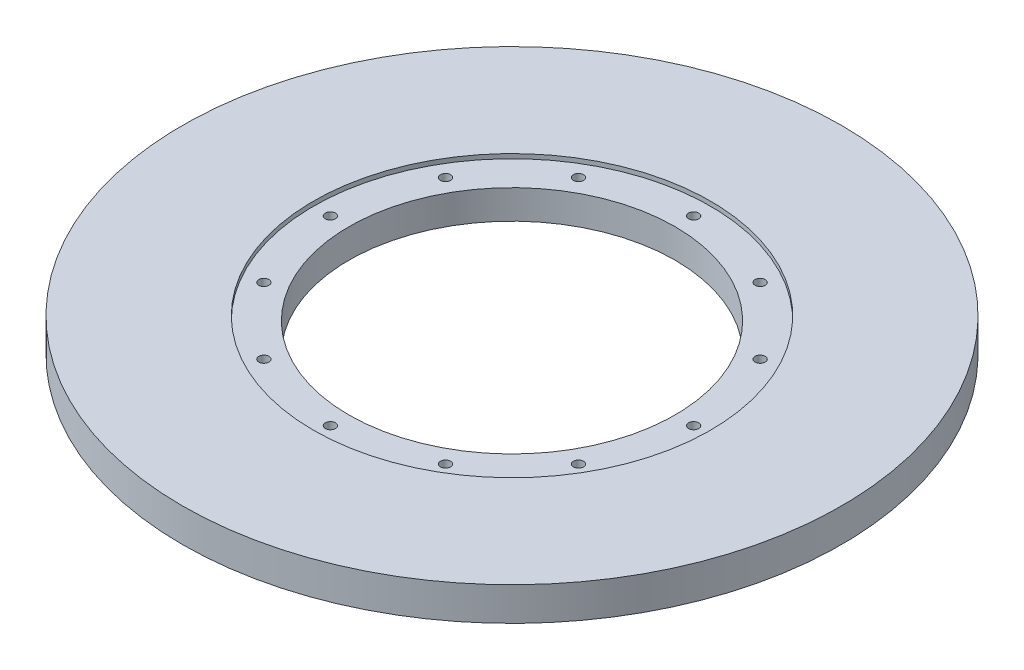
ISO-10303-21;
HEADER;
FILE_DESCRIPTION(('STEP AP214'),'2;1');
FILE_NAME('part.step','',(''),(''),'','','');
FILE_SCHEMA(('AUTOMOTIVE_DESIGN { 1 0 10303 214 1 1 1 1 }'));
ENDSEC;
DATA;
#1=APPLICATION_CONTEXT('core data for automotive mechanical design processes');
#2=APPLICATION_PROTOCOL_DEFINITION('international standard','automotive_design',2000,#1);
#3=PRODUCT_CONTEXT('',#1,'mechanical');
#4=PRODUCT('Part','Part','',(#3));
#5=PRODUCT_RELATED_PRODUCT_CATEGORY('part','',(#4));
#6=PRODUCT_DEFINITION_FORMATION('','',#4);
#7=PRODUCT_DEFINITION_CONTEXT('part definition',#1,'design');
#8=PRODUCT_DEFINITION('design','',#6,#7);
#9=PRODUCT_DEFINITION_SHAPE('','',#8);
#10=(LENGTH_UNIT() NAMED_UNIT(*) SI_UNIT(.MILLI.,.METRE.));
#11=(NAMED_UNIT(*) PLANE_ANGLE_UNIT() SI_UNIT($,.RADIAN.));
#12=(NAMED_UNIT(*) SI_UNIT($,.STERADIAN.) SOLID_ANGLE_UNIT());
#13=UNCERTAINTY_MEASURE_WITH_UNIT(LENGTH_MEASURE(1.E-05),#10,'distance_accuracy_value','');
#14=(GEOMETRIC_REPRESENTATION_CONTEXT(3) GLOBAL_UNCERTAINTY_ASSIGNED_CONTEXT((#13)) GLOBAL_UNIT_ASSIGNED_CONTEXT((#10,
#11,#12)) REPRESENTATION_CONTEXT('',''));
#15=CARTESIAN_POINT('',(0.,0.,0.));
#16=DIRECTION('',(0.,0.,1.));
#17=DIRECTION('',(1.,0.,0.));
#18=AXIS2_PLACEMENT_3D('',#15,#16,#17);
#19=CARTESIAN_POINT('',(63.8175,0.,-63.8175));
#20=DIRECTION('',(0.,1.,0.));
#21=DIRECTION('',(0.,0.,1.));
#22=AXIS2_PLACEMENT_3D('',#19,#20,#21);
#23=CYLINDRICAL_SURFACE('',#22,46.355);
#24=CARTESIAN_POINT('',(63.8175,0.,-63.8175));
#25=DIRECTION('',(0.,1.,0.));
#26=DIRECTION('',(0.,0.,1.));
#27=AXIS2_PLACEMENT_3D('',#24,#25,#26);
#28=CIRCLE('',#27,46.355);
#29=CARTESIAN_POINT('',(63.8175,0.,-17.4625));
#30=VERTEX_POINT('',#29);
#31=EDGE_CURVE('E53',#30,#30,#28,.T.);
#32=ORIENTED_EDGE('',*,*,#31,.F.);
#33=EDGE_LOOP('',(#32));
#34=FACE_BOUND('',#33,.T.);
#35=CARTESIAN_POINT('',(63.8175,8.255,-63.8175));
#36=DIRECTION('',(0.,1.,0.));
#37=DIRECTION('',(0.,0.,1.));
#38=AXIS2_PLACEMENT_3D('',#35,#36,#37);
#39=CIRCLE('',#38,46.355);
#40=CARTESIAN_POINT('',(63.8175,8.255,-17.4625));
#41=VERTEX_POINT('',#40);
#42=EDGE_CURVE('E92',#41,#41,#39,.F.);
#43=ORIENTED_EDGE('',*,*,#42,.F.);
#44=EDGE_LOOP('',(#43));
#45=FACE_BOUND('',#44,.T.);
#46=ADVANCED_FACE('F35',(#34,#45),#23,.F.);
#47=CARTESIAN_POINT('',(63.8175,0.,-115.443));
#48=DIRECTION('',(0.,1.,0.));
#49=DIRECTION('',(0.,0.,1.));
#50=AXIS2_PLACEMENT_3D('',#47,#48,#49);
#51=CYLINDRICAL_SURFACE('',#50,1.4351);
#52=CARTESIAN_POINT('',(63.8175,0.,-115.443));
#53=DIRECTION('',(0.,1.,0.));
#54=DIRECTION('',(0.,0.,1.));
#55=AXIS2_PLACEMENT_3D('',#52,#53,#54);
#56=CIRCLE('',#55,1.4351);
#57=CARTESIAN_POINT('',(63.8175,0.,-114.0079));
#58=VERTEX_POINT('',#57);
#59=EDGE_CURVE('E58',#58,#58,#56,.T.);
#60=ORIENTED_EDGE('',*,*,#59,.F.);
#61=EDGE_LOOP('',(#60));
#62=FACE_BOUND('',#61,.T.);
#63=CARTESIAN_POINT('',(63.8175,8.255,-115.443));
#64=DIRECTION('',(0.,1.,0.));
#65=DIRECTION('',(0.,0.,1.));
#66=AXIS2_PLACEMENT_3D('',#63,#64,#65);
#67=CIRCLE('',#66,1.4351);
#68=CARTESIAN_POINT('',(63.8175,8.255,-114.0079));
#69=VERTEX_POINT('',#68);
#70=EDGE_CURVE('E97',#69,#69,#67,.F.);
#71=ORIENTED_EDGE('',*,*,#70,.F.);
#72=EDGE_LOOP('',(#71));
#73=FACE_BOUND('',#72,.T.);
#74=ADVANCED_FACE('F162',(#62,#73),#51,.F.);
#75=CARTESIAN_POINT('',(38.0047499999999,0.,-108.526494483073));
#76=DIRECTION('',(0.,1.,0.));
#77=DIRECTION('',(0.,0.,1.));
#78=AXIS2_PLACEMENT_3D('',#75,#76,#77);
#79=CYLINDRICAL_SURFACE('',#78,1.4351);
#80=CARTESIAN_POINT('',(38.0047499999999,0.,-108.526494483073));
#81=DIRECTION('',(0.,1.,0.));
#82=DIRECTION('',(0.500000000000001,0.,0.866025403784438));
#83=AXIS2_PLACEMENT_3D('',#80,#81,#82);
#84=CIRCLE('',#83,1.4351);
#85=CARTESIAN_POINT('',(38.7222999999999,0.,-107.283661426102));
#86=VERTEX_POINT('',#85);
#87=EDGE_CURVE('E61',#86,#86,#84,.T.);
#88=ORIENTED_EDGE('',*,*,#87,.F.);
#89=EDGE_LOOP('',(#88));
#90=FACE_BOUND('',#89,.T.);
#91=CARTESIAN_POINT('',(38.0047499999999,8.255,-108.526494483073));
#92=DIRECTION('',(0.,1.,0.));
#93=DIRECTION('',(0.,0.,1.));
#94=AXIS2_PLACEMENT_3D('',#91,#92,#93);
#95=CIRCLE('',#94,1.4351);
#96=CARTESIAN_POINT('',(38.0047499999999,8.255,-107.091394483074));
#97=VERTEX_POINT('',#96);
#98=EDGE_CURVE('E100',#97,#97,#95,.F.);
#99=ORIENTED_EDGE('',*,*,#98,.F.);
#100=EDGE_LOOP('',(#99));
#101=FACE_BOUND('',#100,.T.);
#102=ADVANCED_FACE('F168',(#90,#101),#79,.F.);
#103=CARTESIAN_POINT('',(89.6302499999994,0.,-108.526494483074));
#104=DIRECTION('',(0.,1.,0.));
#105=DIRECTION('',(0.,0.,1.));
#106=AXIS2_PLACEMENT_3D('',#103,#104,#105);
#107=CYLINDRICAL_SURFACE('',#106,1.4351);
#108=CARTESIAN_POINT('',(89.6302499999994,0.,-108.526494483074));
#109=DIRECTION('',(0.,1.,0.));
#110=DIRECTION('',(-0.499999999999989,0.,0.866025403784445));
#111=AXIS2_PLACEMENT_3D('',#108,#109,#110);
#112=CIRCLE('',#111,1.4351);
#113=CARTESIAN_POINT('',(88.9126999999994,0.,-107.283661426103));
#114=VERTEX_POINT('',#113);
#115=EDGE_CURVE('E89',#114,#114,#112,.T.);
#116=ORIENTED_EDGE('',*,*,#115,.F.);
#117=EDGE_LOOP('',(#116));
#118=FACE_BOUND('',#117,.T.);
#119=CARTESIAN_POINT('',(89.6302499999994,8.255,-108.526494483074));
#120=DIRECTION('',(0.,1.,0.));
#121=DIRECTION('',(0.,0.,1.));
#122=AXIS2_PLACEMENT_3D('',#119,#120,#121);
#123=CIRCLE('',#122,1.4351);
#124=CARTESIAN_POINT('',(89.6302499999994,8.255,-107.091394483074));
#125=VERTEX_POINT('',#124);
#126=EDGE_CURVE('E103',#125,#125,#123,.F.);
#127=ORIENTED_EDGE('',*,*,#126,.F.);
#128=EDGE_LOOP('',(#127));
#129=FACE_BOUND('',#128,.T.);
#130=ADVANCED_FACE('F209',(#118,#129),#107,.F.);
#131=CARTESIAN_POINT('',(108.526494483073,0.,-89.6302500000005));
#132=DIRECTION('',(0.,1.,0.));
#133=DIRECTION('',(0.,0.,1.));
#134=AXIS2_PLACEMENT_3D('',#131,#132,#133);
#135=CYLINDRICAL_SURFACE('',#134,1.4351);
#136=CARTESIAN_POINT('',(108.526494483073,0.,-89.6302500000005));
#137=DIRECTION('',(0.,1.,0.));
#138=DIRECTION('',(-0.866025403784433,0.,0.50000000000001));
#139=AXIS2_PLACEMENT_3D('',#136,#137,#138);
#140=CIRCLE('',#139,1.4351);
#141=CARTESIAN_POINT('',(107.283661426102,0.,-88.9127000000005));
#142=VERTEX_POINT('',#141);
#143=EDGE_CURVE('E69',#142,#142,#140,.T.);
#144=ORIENTED_EDGE('',*,*,#143,.F.);
#145=EDGE_LOOP('',(#144));
#146=FACE_BOUND('',#145,.T.);
#147=CARTESIAN_POINT('',(108.526494483073,8.255,-89.6302500000005));
#148=DIRECTION('',(0.,1.,0.));
#149=DIRECTION('',(0.,0.,1.));
#150=AXIS2_PLACEMENT_3D('',#147,#148,#149);
#151=CIRCLE('',#150,1.4351);
#152=CARTESIAN_POINT('',(108.526494483073,8.255,-88.1951500000005));
#153=VERTEX_POINT('',#152);
#154=EDGE_CURVE('E106',#153,#153,#151,.F.);
#155=ORIENTED_EDGE('',*,*,#154,.F.);
#156=EDGE_LOOP('',(#155));
#157=FACE_BOUND('',#156,.T.);
#158=ADVANCED_FACE('F206',(#146,#157),#135,.F.);
#159=CARTESIAN_POINT('',(115.443,0.,-63.8175000000006));
#160=DIRECTION('',(0.,1.,0.));
#161=DIRECTION('',(0.,0.,1.));
#162=AXIS2_PLACEMENT_3D('',#159,#160,#161);
#163=CYLINDRICAL_SURFACE('',#162,1.4351);
#164=CARTESIAN_POINT('',(115.443,0.,-63.8175000000006));
#165=DIRECTION('',(0.,1.,0.));
#166=DIRECTION('',(-1.,0.,0.));
#167=AXIS2_PLACEMENT_3D('',#164,#165,#166);
#168=CIRCLE('',#167,1.4351);
#169=CARTESIAN_POINT('',(114.0079,0.,-63.8175000000005));
#170=VERTEX_POINT('',#169);
#171=EDGE_CURVE('E65',#170,#170,#168,.T.);
#172=ORIENTED_EDGE('',*,*,#171,.F.);
#173=EDGE_LOOP('',(#172));
#174=FACE_BOUND('',#173,.T.);
#175=CARTESIAN_POINT('',(115.443,8.255,-63.8175000000006));
#176=DIRECTION('',(0.,1.,0.));
#177=DIRECTION('',(0.,0.,1.));
#178=AXIS2_PLACEMENT_3D('',#175,#176,#177);
#179=CIRCLE('',#178,1.4351);
#180=CARTESIAN_POINT('',(115.443,8.255,-62.3824000000006));
#181=VERTEX_POINT('',#180);
#182=EDGE_CURVE('E109',#181,#181,#179,.F.);
#183=ORIENTED_EDGE('',*,*,#182,.F.);
#184=EDGE_LOOP('',(#183));
#185=FACE_BOUND('',#184,.T.);
#186=ADVANCED_FACE('F208',(#174,#185),#163,.F.);
#187=CARTESIAN_POINT('',(108.526494483074,0.,-38.0047500000004));
#188=DIRECTION('',(0.,1.,0.));
#189=DIRECTION('',(0.,0.,1.));
#190=AXIS2_PLACEMENT_3D('',#187,#188,#189);
#191=CYLINDRICAL_SURFACE('',#190,1.4351);
#192=CARTESIAN_POINT('',(108.526494483074,0.,-38.0047500000004));
#193=DIRECTION('',(0.,1.,0.));
#194=DIRECTION('',(-0.866025403784443,0.,-0.499999999999992));
#195=AXIS2_PLACEMENT_3D('',#192,#193,#194);
#196=CIRCLE('',#195,1.4351);
#197=CARTESIAN_POINT('',(107.283661426103,0.,-38.7223000000004));
#198=VERTEX_POINT('',#197);
#199=EDGE_CURVE('E68',#198,#198,#196,.T.);
#200=ORIENTED_EDGE('',*,*,#199,.F.);
#201=EDGE_LOOP('',(#200));
#202=FACE_BOUND('',#201,.T.);
#203=CARTESIAN_POINT('',(108.526494483074,8.255,-38.0047500000004));
#204=DIRECTION('',(0.,1.,0.));
#205=DIRECTION('',(0.,0.,1.));
#206=AXIS2_PLACEMENT_3D('',#203,#204,#205);
#207=CIRCLE('',#206,1.4351);
#208=CARTESIAN_POINT('',(108.526494483074,8.255,-36.5696500000004));
#209=VERTEX_POINT('',#208);
#210=EDGE_CURVE('E112',#209,#209,#207,.F.);
#211=ORIENTED_EDGE('',*,*,#210,.F.);
#212=EDGE_LOOP('',(#211));
#213=FACE_BOUND('',#212,.T.);
#214=ADVANCED_FACE('F241',(#202,#213),#191,.F.);
#215=CARTESIAN_POINT('',(89.6302500000004,0.,-19.1085055169267));
#216=DIRECTION('',(0.,1.,0.));
#217=DIRECTION('',(0.,0.,1.));
#218=AXIS2_PLACEMENT_3D('',#215,#216,#217);
#219=CYLINDRICAL_SURFACE('',#218,1.4351);
#220=CARTESIAN_POINT('',(89.6302500000004,0.,-19.1085055169267));
#221=DIRECTION('',(0.,1.,0.));
#222=DIRECTION('',(-0.500000000000007,0.,-0.866025403784435));
#223=AXIS2_PLACEMENT_3D('',#220,#221,#222);
#224=CIRCLE('',#223,1.4351);
#225=CARTESIAN_POINT('',(88.9127000000003,0.,-20.3513385738977));
#226=VERTEX_POINT('',#225);
#227=EDGE_CURVE('E72',#226,#226,#224,.T.);
#228=ORIENTED_EDGE('',*,*,#227,.F.);
#229=EDGE_LOOP('',(#228));
#230=FACE_BOUND('',#229,.T.);
#231=CARTESIAN_POINT('',(89.6302500000004,8.255,-19.1085055169267));
#232=DIRECTION('',(0.,1.,0.));
#233=DIRECTION('',(0.,0.,1.));
#234=AXIS2_PLACEMENT_3D('',#231,#232,#233);
#235=CIRCLE('',#234,1.4351);
#236=CARTESIAN_POINT('',(89.6302500000004,8.255,-17.6734055169267));
#237=VERTEX_POINT('',#236);
#238=EDGE_CURVE('E115',#237,#237,#235,.F.);
#239=ORIENTED_EDGE('',*,*,#238,.F.);
#240=EDGE_LOOP('',(#239));
#241=FACE_BOUND('',#240,.T.);
#242=ADVANCED_FACE('F245',(#230,#241),#219,.F.);
#243=CARTESIAN_POINT('',(63.8175,0.,-12.192));
#244=DIRECTION('',(0.,1.,0.));
#245=DIRECTION('',(0.,0.,1.));
#246=AXIS2_PLACEMENT_3D('',#243,#244,#245);
#247=CYLINDRICAL_SURFACE('',#246,1.4351);
#248=CARTESIAN_POINT('',(63.8175,0.,-12.192));
#249=DIRECTION('',(0.,1.,0.));
#250=DIRECTION('',(0.,0.,-1.));
#251=AXIS2_PLACEMENT_3D('',#248,#249,#250);
#252=CIRCLE('',#251,1.4351);
#253=CARTESIAN_POINT('',(63.8175,0.,-13.6271));
#254=VERTEX_POINT('',#253);
#255=EDGE_CURVE('E75',#254,#254,#252,.T.);
#256=ORIENTED_EDGE('',*,*,#255,.F.);
#257=EDGE_LOOP('',(#256));
#258=FACE_BOUND('',#257,.T.);
#259=CARTESIAN_POINT('',(63.8175,8.255,-12.192));
#260=DIRECTION('',(0.,1.,0.));
#261=DIRECTION('',(0.,0.,1.));
#262=AXIS2_PLACEMENT_3D('',#259,#260,#261);
#263=CIRCLE('',#262,1.4351);
#264=CARTESIAN_POINT('',(63.8175,8.255,-10.7569));
#265=VERTEX_POINT('',#264);
#266=EDGE_CURVE('E118',#265,#265,#263,.F.);
#267=ORIENTED_EDGE('',*,*,#266,.F.);
#268=EDGE_LOOP('',(#267));
#269=FACE_BOUND('',#268,.T.);
#270=ADVANCED_FACE('F249',(#258,#269),#247,.F.);
#271=CARTESIAN_POINT('',(38.0047500000003,0.,-19.1085055169263));
#272=DIRECTION('',(0.,1.,0.));
#273=DIRECTION('',(0.,0.,1.));
#274=AXIS2_PLACEMENT_3D('',#271,#272,#273);
#275=CYLINDRICAL_SURFACE('',#274,1.4351);
#276=CARTESIAN_POINT('',(38.0047500000003,0.,-19.1085055169263));
#277=DIRECTION('',(0.,1.,0.));
#278=DIRECTION('',(0.499999999999995,0.,-0.866025403784442));
#279=AXIS2_PLACEMENT_3D('',#276,#277,#278);
#280=CIRCLE('',#279,1.4351);
#281=CARTESIAN_POINT('',(38.7223000000002,0.,-20.3513385738974));
#282=VERTEX_POINT('',#281);
#283=EDGE_CURVE('E78',#282,#282,#280,.T.);
#284=ORIENTED_EDGE('',*,*,#283,.F.);
#285=EDGE_LOOP('',(#284));
#286=FACE_BOUND('',#285,.T.);
#287=CARTESIAN_POINT('',(38.0047500000003,8.255,-19.1085055169263));
#288=DIRECTION('',(0.,1.,0.));
#289=DIRECTION('',(0.,0.,1.));
#290=AXIS2_PLACEMENT_3D('',#287,#288,#289);
#291=CIRCLE('',#290,1.4351);
#292=CARTESIAN_POINT('',(38.0047500000003,8.255,-17.6734055169263));
#293=VERTEX_POINT('',#292);
#294=EDGE_CURVE('E121',#293,#293,#291,.F.);
#295=ORIENTED_EDGE('',*,*,#294,.F.);
#296=EDGE_LOOP('',(#295));
#297=FACE_BOUND('',#296,.T.);
#298=ADVANCED_FACE('F253',(#286,#297),#275,.F.);
#299=CARTESIAN_POINT('',(19.1085055169266,0.,-38.0047499999998));
#300=DIRECTION('',(0.,1.,0.));
#301=DIRECTION('',(0.,0.,1.));
#302=AXIS2_PLACEMENT_3D('',#299,#300,#301);
#303=CYLINDRICAL_SURFACE('',#302,1.4351);
#304=CARTESIAN_POINT('',(19.1085055169266,0.,-38.0047499999998));
#305=DIRECTION('',(0.,1.,0.));
#306=DIRECTION('',(0.866025403784436,0.,-0.500000000000004));
#307=AXIS2_PLACEMENT_3D('',#304,#305,#306);
#308=CIRCLE('',#307,1.4351);
#309=CARTESIAN_POINT('',(20.3513385738976,0.,-38.7222999999998));
#310=VERTEX_POINT('',#309);
#311=EDGE_CURVE('E81',#310,#310,#308,.T.);
#312=ORIENTED_EDGE('',*,*,#311,.F.);
#313=EDGE_LOOP('',(#312));
#314=FACE_BOUND('',#313,.T.);
#315=CARTESIAN_POINT('',(19.1085055169266,8.255,-38.0047499999998));
#316=DIRECTION('',(0.,1.,0.));
#317=DIRECTION('',(0.,0.,1.));
#318=AXIS2_PLACEMENT_3D('',#315,#316,#317);
#319=CIRCLE('',#318,1.4351);
#320=CARTESIAN_POINT('',(19.1085055169266,8.255,-36.5696499999998));
#321=VERTEX_POINT('',#320);
#322=EDGE_CURVE('E124',#321,#321,#319,.F.);
#323=ORIENTED_EDGE('',*,*,#322,.F.);
#324=EDGE_LOOP('',(#323));
#325=FACE_BOUND('',#324,.T.);
#326=ADVANCED_FACE('F156',(#314,#325),#303,.F.);
#327=CARTESIAN_POINT('',(12.192,0.,-63.8174999999998));
#328=DIRECTION('',(0.,1.,0.));
#329=DIRECTION('',(0.,0.,1.));
#330=AXIS2_PLACEMENT_3D('',#327,#328,#329);
#331=CYLINDRICAL_SURFACE('',#330,1.4351);
#332=CARTESIAN_POINT('',(12.192,0.,-63.8174999999998));
#333=DIRECTION('',(0.,1.,0.));
#334=DIRECTION('',(1.,0.,0.));
#335=AXIS2_PLACEMENT_3D('',#332,#333,#334);
#336=CIRCLE('',#335,1.4351);
#337=CARTESIAN_POINT('',(13.6271,0.,-63.8174999999998));
#338=VERTEX_POINT('',#337);
#339=EDGE_CURVE('E84',#338,#338,#336,.T.);
#340=ORIENTED_EDGE('',*,*,#339,.F.);
#341=EDGE_LOOP('',(#340));
#342=FACE_BOUND('',#341,.T.);
#343=CARTESIAN_POINT('',(12.192,8.255,-63.8174999999998));
#344=DIRECTION('',(0.,1.,0.));
#345=DIRECTION('',(0.,0.,1.));
#346=AXIS2_PLACEMENT_3D('',#343,#344,#345);
#347=CIRCLE('',#346,1.4351);
#348=CARTESIAN_POINT('',(12.192,8.255,-62.3823999999998));
#349=VERTEX_POINT('',#348);
#350=EDGE_CURVE('E127',#349,#349,#347,.F.);
#351=ORIENTED_EDGE('',*,*,#350,.F.);
#352=EDGE_LOOP('',(#351));
#353=FACE_BOUND('',#352,.T.);
#354=ADVANCED_FACE('F146',(#342,#353),#331,.F.);
#355=CARTESIAN_POINT('',(19.1085055169264,0.,-89.6302499999999));
#356=DIRECTION('',(0.,1.,0.));
#357=DIRECTION('',(0.,0.,1.));
#358=AXIS2_PLACEMENT_3D('',#355,#356,#357);
#359=CYLINDRICAL_SURFACE('',#358,1.4351);
#360=CARTESIAN_POINT('',(19.1085055169264,0.,-89.6302499999999));
#361=DIRECTION('',(0.,1.,0.));
#362=DIRECTION('',(0.86602540378444,0.,0.499999999999998));
#363=AXIS2_PLACEMENT_3D('',#360,#361,#362);
#364=CIRCLE('',#363,1.4351);
#365=CARTESIAN_POINT('',(20.3513385738974,0.,-88.9126999999999));
#366=VERTEX_POINT('',#365);
#367=EDGE_CURVE('E64',#366,#366,#364,.T.);
#368=ORIENTED_EDGE('',*,*,#367,.F.);
#369=EDGE_LOOP('',(#368));
#370=FACE_BOUND('',#369,.T.);
#371=CARTESIAN_POINT('',(19.1085055169264,8.255,-89.6302499999999));
#372=DIRECTION('',(0.,1.,0.));
#373=DIRECTION('',(0.,0.,1.));
#374=AXIS2_PLACEMENT_3D('',#371,#372,#373);
#375=CIRCLE('',#374,1.4351);
#376=CARTESIAN_POINT('',(19.1085055169264,8.255,-88.1951499999999));
#377=VERTEX_POINT('',#376);
#378=EDGE_CURVE('E39',#377,#377,#375,.F.);
#379=ORIENTED_EDGE('',*,*,#378,.F.);
#380=EDGE_LOOP('',(#379));
#381=FACE_BOUND('',#380,.T.);
#382=ADVANCED_FACE('F143',(#370,#381),#359,.F.);
#383=CARTESIAN_POINT('',(63.8175,-264.91755557154,-63.8175));
#384=DIRECTION('',(0.,1.,0.));
#385=DIRECTION('',(0.,0.,1.));
#386=AXIS2_PLACEMENT_3D('',#383,#384,#385);
#387=CYLINDRICAL_SURFACE('',#386,93.6625);
#388=CARTESIAN_POINT('',(63.8175,9.525,-63.8175));
#389=DIRECTION('',(0.,1.,0.));
#390=DIRECTION('',(0.,0.,1.));
#391=AXIS2_PLACEMENT_3D('',#388,#389,#390);
#392=CIRCLE('',#391,93.6625);
#393=CARTESIAN_POINT('',(63.8175,9.525,29.845));
#394=VERTEX_POINT('',#393);
#395=EDGE_CURVE('E43',#394,#394,#392,.T.);
#396=ORIENTED_EDGE('',*,*,#395,.F.);
#397=EDGE_LOOP('',(#396));
#398=FACE_BOUND('',#397,.T.);
#399=CARTESIAN_POINT('',(63.8175,0.,-63.8175));
#400=DIRECTION('',(0.,-1.,0.));
#401=DIRECTION('',(0.,0.,-1.));
#402=AXIS2_PLACEMENT_3D('',#399,#400,#401);
#403=CIRCLE('',#402,93.6625);
#404=CARTESIAN_POINT('',(63.8175,0.,-157.48));
#405=VERTEX_POINT('',#404);
#406=EDGE_CURVE('E10',#405,#405,#403,.F.);
#407=ORIENTED_EDGE('',*,*,#406,.T.);
#408=EDGE_LOOP('',(#407));
#409=FACE_BOUND('',#408,.T.);
#410=ADVANCED_FACE('F145',(#398,#409),#387,.T.);
#411=CARTESIAN_POINT('',(0.,9.525,0.));
#412=DIRECTION('',(0.,-1.,0.));
#413=DIRECTION('',(0.,0.,-1.));
#414=AXIS2_PLACEMENT_3D('',#411,#412,#413);
#415=PLANE('',#414);
#416=CARTESIAN_POINT('',(63.8175,9.525,-63.8175));
#417=DIRECTION('',(0.,1.,0.));
#418=DIRECTION('',(0.,0.,1.));
#419=AXIS2_PLACEMENT_3D('',#416,#417,#418);
#420=CIRCLE('',#419,56.41975);
#421=CARTESIAN_POINT('',(63.8175,9.525,-7.39774999999999));
#422=VERTEX_POINT('',#421);
#423=EDGE_CURVE('E130',#422,#422,#420,.T.);
#424=ORIENTED_EDGE('',*,*,#423,.F.);
#425=EDGE_LOOP('',(#424));
#426=FACE_BOUND('',#425,.T.);
#427=ORIENTED_EDGE('',*,*,#395,.T.);
#428=EDGE_LOOP('',(#427));
#429=FACE_BOUND('',#428,.T.);
#430=ADVANCED_FACE('F153',(#426,#429),#415,.F.);
#431=CARTESIAN_POINT('',(0.,0.,0.));
#432=DIRECTION('',(0.,-1.,0.));
#433=DIRECTION('',(0.,0.,-1.));
#434=AXIS2_PLACEMENT_3D('',#431,#432,#433);
#435=PLANE('',#434);
#436=ORIENTED_EDGE('',*,*,#367,.T.);
#437=EDGE_LOOP('',(#436));
#438=FACE_BOUND('',#437,.T.);
#439=ORIENTED_EDGE('',*,*,#339,.T.);
#440=EDGE_LOOP('',(#439));
#441=FACE_BOUND('',#440,.T.);
#442=ORIENTED_EDGE('',*,*,#311,.T.);
#443=EDGE_LOOP('',(#442));
#444=FACE_BOUND('',#443,.T.);
#445=ORIENTED_EDGE('',*,*,#283,.T.);
#446=EDGE_LOOP('',(#445));
#447=FACE_BOUND('',#446,.T.);
#448=ORIENTED_EDGE('',*,*,#255,.T.);
#449=EDGE_LOOP('',(#448));
#450=FACE_BOUND('',#449,.T.);
#451=ORIENTED_EDGE('',*,*,#227,.T.);
#452=EDGE_LOOP('',(#451));
#453=FACE_BOUND('',#452,.T.);
#454=ORIENTED_EDGE('',*,*,#199,.T.);
#455=EDGE_LOOP('',(#454));
#456=FACE_BOUND('',#455,.T.);
#457=ORIENTED_EDGE('',*,*,#171,.T.);
#458=EDGE_LOOP('',(#457));
#459=FACE_BOUND('',#458,.T.);
#460=ORIENTED_EDGE('',*,*,#143,.T.);
#461=EDGE_LOOP('',(#460));
#462=FACE_BOUND('',#461,.T.);
#463=ORIENTED_EDGE('',*,*,#115,.T.);
#464=EDGE_LOOP('',(#463));
#465=FACE_BOUND('',#464,.T.);
#466=ORIENTED_EDGE('',*,*,#87,.T.);
#467=EDGE_LOOP('',(#466));
#468=FACE_BOUND('',#467,.T.);
#469=ORIENTED_EDGE('',*,*,#59,.T.);
#470=EDGE_LOOP('',(#469));
#471=FACE_BOUND('',#470,.T.);
#472=ORIENTED_EDGE('',*,*,#31,.T.);
#473=EDGE_LOOP('',(#472));
#474=FACE_BOUND('',#473,.T.);
#475=ORIENTED_EDGE('',*,*,#406,.F.);
#476=EDGE_LOOP('',(#475));
#477=FACE_BOUND('',#476,.T.);
#478=ADVANCED_FACE('F37',(#438,#441,#444,#447,#450,#453,#456,#459,#462,#465,#468,#471,#474,
#477),#435,.T.);
#479=CARTESIAN_POINT('',(63.8175,8.255,-63.8175));
#480=DIRECTION('',(0.,1.,0.));
#481=DIRECTION('',(0.,0.,1.));
#482=AXIS2_PLACEMENT_3D('',#479,#480,#481);
#483=PLANE('',#482);
#484=CARTESIAN_POINT('',(63.8175,8.255,-63.8175));
#485=DIRECTION('',(0.,1.,0.));
#486=DIRECTION('',(0.,0.,1.));
#487=AXIS2_PLACEMENT_3D('',#484,#485,#486);
#488=CIRCLE('',#487,56.41975);
#489=CARTESIAN_POINT('',(63.8175,8.255,-7.39774999999999));
#490=VERTEX_POINT('',#489);
#491=EDGE_CURVE('E133',#490,#490,#488,.T.);
#492=ORIENTED_EDGE('',*,*,#491,.T.);
#493=EDGE_LOOP('',(#492));
#494=FACE_BOUND('',#493,.T.);
#495=ORIENTED_EDGE('',*,*,#378,.T.);
#496=EDGE_LOOP('',(#495));
#497=FACE_BOUND('',#496,.T.);
#498=ORIENTED_EDGE('',*,*,#350,.T.);
#499=EDGE_LOOP('',(#498));
#500=FACE_BOUND('',#499,.T.);
#501=ORIENTED_EDGE('',*,*,#322,.T.);
#502=EDGE_LOOP('',(#501));
#503=FACE_BOUND('',#502,.T.);
#504=ORIENTED_EDGE('',*,*,#294,.T.);
#505=EDGE_LOOP('',(#504));
#506=FACE_BOUND('',#505,.T.);
#507=ORIENTED_EDGE('',*,*,#266,.T.);
#508=EDGE_LOOP('',(#507));
#509=FACE_BOUND('',#508,.T.);
#510=ORIENTED_EDGE('',*,*,#238,.T.);
#511=EDGE_LOOP('',(#510));
#512=FACE_BOUND('',#511,.T.);
#513=ORIENTED_EDGE('',*,*,#210,.T.);
#514=EDGE_LOOP('',(#513));
#515=FACE_BOUND('',#514,.T.);
#516=ORIENTED_EDGE('',*,*,#182,.T.);
#517=EDGE_LOOP('',(#516));
#518=FACE_BOUND('',#517,.T.);
#519=ORIENTED_EDGE('',*,*,#154,.T.);
#520=EDGE_LOOP('',(#519));
#521=FACE_BOUND('',#520,.T.);
#522=ORIENTED_EDGE('',*,*,#126,.T.);
#523=EDGE_LOOP('',(#522));
#524=FACE_BOUND('',#523,.T.);
#525=ORIENTED_EDGE('',*,*,#98,.T.);
#526=EDGE_LOOP('',(#525));
#527=FACE_BOUND('',#526,.T.);
#528=ORIENTED_EDGE('',*,*,#70,.T.);
#529=EDGE_LOOP('',(#528));
#530=FACE_BOUND('',#529,.T.);
#531=ORIENTED_EDGE('',*,*,#42,.T.);
#532=EDGE_LOOP('',(#531));
#533=FACE_BOUND('',#532,.T.);
#534=ADVANCED_FACE('F140',(#494,#497,#500,#503,#506,#509,#512,#515,#518,#521,#524,#527,#530,
#533),#483,.T.);
#535=CARTESIAN_POINT('',(63.8175,8.255,-63.8175));
#536=DIRECTION('',(0.,1.,0.));
#537=DIRECTION('',(0.,0.,1.));
#538=AXIS2_PLACEMENT_3D('',#535,#536,#537);
#539=CYLINDRICAL_SURFACE('',#538,56.41975);
#540=ORIENTED_EDGE('',*,*,#491,.F.);
#541=EDGE_LOOP('',(#540));
#542=FACE_BOUND('',#541,.T.);
#543=ORIENTED_EDGE('',*,*,#423,.T.);
#544=EDGE_LOOP('',(#543));
#545=FACE_BOUND('',#544,.T.);
#546=ADVANCED_FACE('F197',(#542,#545),#539,.F.);
#547=CLOSED_SHELL('',(#46,#74,#102,#130,#158,#186,#214,#242,#270,#298,#326,#354,#382,#410,#430,
#478,#534,#546));
#548=CARTESIAN_POINT('',(114.935,4.7625,-4.76250000000004));
#549=DIRECTION('',(1.,0.,0.));
#550=DIRECTION('',(0.,0.,-1.));
#551=AXIS2_PLACEMENT_3D('',#548,#549,#550);
#552=CYLINDRICAL_SURFACE('',#551,1.35255);
#553=CARTESIAN_POINT('',(114.935,4.7625,-4.76250000000004));
#554=DIRECTION('',(1.,0.,0.));
#555=DIRECTION('',(0.,0.,-1.));
#556=AXIS2_PLACEMENT_3D('',#553,#554,#555);
#557=CIRCLE('',#556,1.35255);
#558=CARTESIAN_POINT('',(114.935,4.7625,-6.11505000000004));
#559=VERTEX_POINT('',#558);
#560=EDGE_CURVE('E47',#559,#559,#557,.T.);
#561=ORIENTED_EDGE('',*,*,#560,.F.);
#562=EDGE_LOOP('',(#561));
#563=FACE_BOUND('',#562,.T.);
#564=CARTESIAN_POINT('',(127.635,4.7625,-4.76250000000004));
#565=DIRECTION('',(1.,0.,0.));
#566=DIRECTION('',(0.,0.,-1.));
#567=AXIS2_PLACEMENT_3D('',#564,#565,#566);
#568=CIRCLE('',#567,1.35255);
#569=CARTESIAN_POINT('',(127.635,4.7625,-6.11505000000004));
#570=VERTEX_POINT('',#569);
#571=EDGE_CURVE('E50',#570,#570,#568,.T.);
#572=ORIENTED_EDGE('',*,*,#571,.T.);
#573=EDGE_LOOP('',(#572));
#574=FACE_BOUND('',#573,.T.);
#575=ADVANCED_FACE('F179',(#563,#574),#552,.F.);
#576=CARTESIAN_POINT('',(114.935,4.7625,-4.76250000000004));
#577=DIRECTION('',(1.,0.,0.));
#578=DIRECTION('',(0.,0.,-1.));
#579=AXIS2_PLACEMENT_3D('',#576,#577,#578);
#580=PLANE('',#579);
#581=ORIENTED_EDGE('',*,*,#560,.T.);
#582=EDGE_LOOP('',(#581));
#583=FACE_BOUND('',#582,.T.);
#584=ADVANCED_FACE('F175',(#583),#580,.T.);
#585=CARTESIAN_POINT('',(127.635,4.7625,-4.76250000000004));
#586=DIRECTION('',(1.,0.,0.));
#587=DIRECTION('',(0.,0.,-1.));
#588=AXIS2_PLACEMENT_3D('',#585,#586,#587);
#589=PLANE('',#588);
#590=ORIENTED_EDGE('',*,*,#571,.F.);
#591=EDGE_LOOP('',(#590));
#592=FACE_BOUND('',#591,.T.);
#593=ADVANCED_FACE('F178',(#592),#589,.F.);
#594=CLOSED_SHELL('',(#575,#584,#593));
#595=ORIENTED_CLOSED_SHELL('',*,#594,.T.);
#596=BREP_WITH_VOIDS('B2',#547,(#595));
#597=ADVANCED_BREP_SHAPE_REPRESENTATION('',(#18,#596),#14);
#598=SHAPE_DEFINITION_REPRESENTATION(#9,#597);
ENDSEC;
END-ISO-10303-21;
